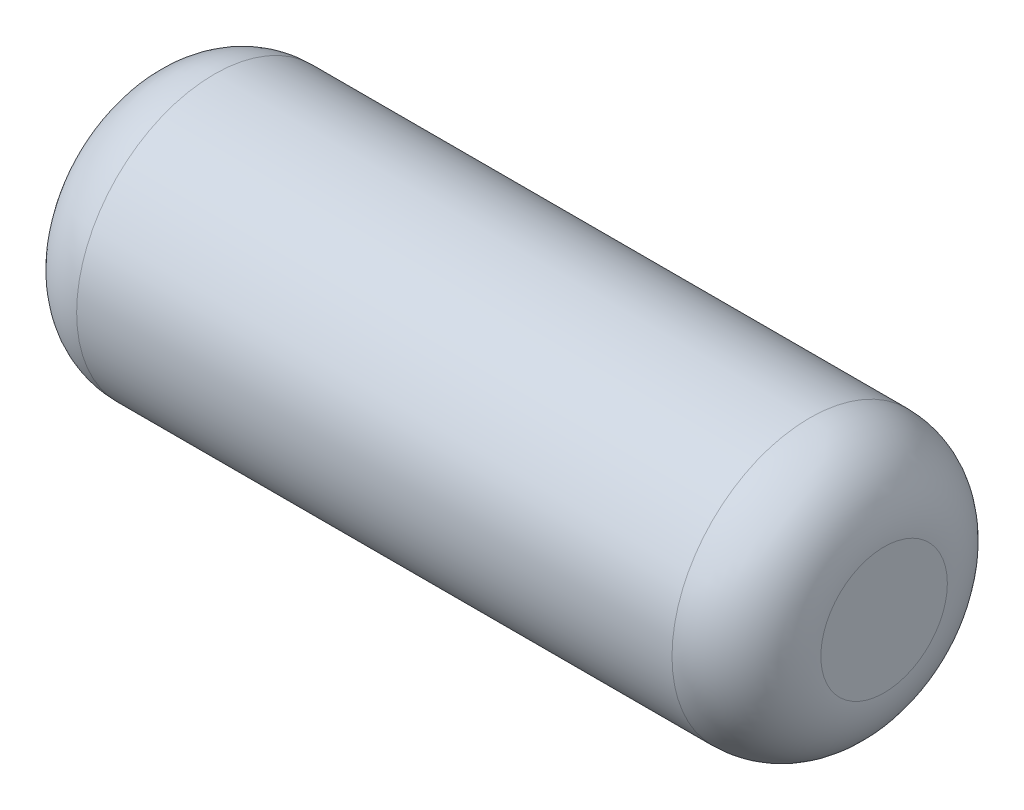
ISO-10303-21;
HEADER;
FILE_DESCRIPTION(('STEP AP214'),'2;1');
FILE_NAME('part.step','',(''),(''),'','','');
FILE_SCHEMA(('AUTOMOTIVE_DESIGN { 1 0 10303 214 1 1 1 1 }'));
ENDSEC;
DATA;
#1=APPLICATION_CONTEXT('core data for automotive mechanical design processes');
#2=APPLICATION_PROTOCOL_DEFINITION('international standard','automotive_design',2000,#1);
#3=PRODUCT_CONTEXT('',#1,'mechanical');
#4=PRODUCT('Part','Part','',(#3));
#5=PRODUCT_RELATED_PRODUCT_CATEGORY('part','',(#4));
#6=PRODUCT_DEFINITION_FORMATION('','',#4);
#7=PRODUCT_DEFINITION_CONTEXT('part definition',#1,'design');
#8=PRODUCT_DEFINITION('design','',#6,#7);
#9=PRODUCT_DEFINITION_SHAPE('','',#8);
#10=(LENGTH_UNIT() NAMED_UNIT(*) SI_UNIT(.MILLI.,.METRE.));
#11=(NAMED_UNIT(*) PLANE_ANGLE_UNIT() SI_UNIT($,.RADIAN.));
#12=(NAMED_UNIT(*) SI_UNIT($,.STERADIAN.) SOLID_ANGLE_UNIT());
#13=UNCERTAINTY_MEASURE_WITH_UNIT(LENGTH_MEASURE(1.E-05),#10,'distance_accuracy_value','');
#14=(GEOMETRIC_REPRESENTATION_CONTEXT(3) GLOBAL_UNCERTAINTY_ASSIGNED_CONTEXT((#13)) GLOBAL_UNIT_ASSIGNED_CONTEXT((#10,
#11,#12)) REPRESENTATION_CONTEXT('',''));
#15=CARTESIAN_POINT('',(0.,0.,0.));
#16=DIRECTION('',(0.,0.,1.));
#17=DIRECTION('',(1.,0.,0.));
#18=AXIS2_PLACEMENT_3D('',#15,#16,#17);
#19=CARTESIAN_POINT('',(12.7,0.,0.));
#20=DIRECTION('',(-1.,0.,0.));
#21=DIRECTION('',(0.,0.,1.));
#22=AXIS2_PLACEMENT_3D('',#19,#20,#21);
#23=CYLINDRICAL_SURFACE('',#22,4.699);
#24=CARTESIAN_POINT('',(-10.16,0.,0.));
#25=DIRECTION('',(1.,0.,0.));
#26=DIRECTION('',(0.,0.,-1.));
#27=AXIS2_PLACEMENT_3D('',#24,#25,#26);
#28=CIRCLE('',#27,4.699);
#29=CARTESIAN_POINT('',(-10.16,0.,-4.699));
#30=VERTEX_POINT('',#29);
#31=EDGE_CURVE('E48',#30,#30,#28,.T.);
#32=ORIENTED_EDGE('',*,*,#31,.T.);
#33=EDGE_LOOP('',(#32));
#34=FACE_BOUND('',#33,.T.);
#35=CARTESIAN_POINT('',(10.16,0.,0.));
#36=DIRECTION('',(1.,0.,0.));
#37=DIRECTION('',(0.,0.,-1.));
#38=AXIS2_PLACEMENT_3D('',#35,#36,#37);
#39=CIRCLE('',#38,4.699);
#40=CARTESIAN_POINT('',(10.16,0.,-4.699));
#41=VERTEX_POINT('',#40);
#42=EDGE_CURVE('E52',#41,#41,#39,.F.);
#43=ORIENTED_EDGE('',*,*,#42,.T.);
#44=EDGE_LOOP('',(#43));
#45=FACE_BOUND('',#44,.T.);
#46=ADVANCED_FACE('F37',(#34,#45),#23,.T.);
#47=CARTESIAN_POINT('',(12.7,0.,0.));
#48=DIRECTION('',(1.,0.,0.));
#49=DIRECTION('',(0.,0.,-1.));
#50=AXIS2_PLACEMENT_3D('',#47,#48,#49);
#51=PLANE('',#50);
#52=CARTESIAN_POINT('',(12.7,0.,0.));
#53=DIRECTION('',(1.,0.,0.));
#54=DIRECTION('',(0.,0.,-1.));
#55=AXIS2_PLACEMENT_3D('',#52,#53,#54);
#56=CIRCLE('',#55,2.159);
#57=CARTESIAN_POINT('',(12.7,0.,-2.159));
#58=VERTEX_POINT('',#57);
#59=EDGE_CURVE('E10',#58,#58,#56,.T.);
#60=ORIENTED_EDGE('',*,*,#59,.T.);
#61=EDGE_LOOP('',(#60));
#62=FACE_BOUND('',#61,.T.);
#63=ADVANCED_FACE('F68',(#62),#51,.T.);
#64=CARTESIAN_POINT('',(-12.7,0.,0.));
#65=DIRECTION('',(1.,0.,0.));
#66=DIRECTION('',(0.,0.,-1.));
#67=AXIS2_PLACEMENT_3D('',#64,#65,#66);
#68=PLANE('',#67);
#69=CARTESIAN_POINT('',(-12.7,0.,0.));
#70=DIRECTION('',(1.,0.,0.));
#71=DIRECTION('',(0.,0.,-1.));
#72=AXIS2_PLACEMENT_3D('',#69,#70,#71);
#73=CIRCLE('',#72,2.159);
#74=CARTESIAN_POINT('',(-12.7,0.,-2.159));
#75=VERTEX_POINT('',#74);
#76=EDGE_CURVE('E44',#75,#75,#73,.F.);
#77=ORIENTED_EDGE('',*,*,#76,.T.);
#78=EDGE_LOOP('',(#77));
#79=FACE_BOUND('',#78,.T.);
#80=ADVANCED_FACE('F65',(#79),#68,.F.);
#81=CARTESIAN_POINT('',(-10.16,0.,0.));
#82=DIRECTION('',(1.,0.,0.));
#83=DIRECTION('',(0.,0.,-1.));
#84=AXIS2_PLACEMENT_3D('',#81,#82,#83);
#85=DEGENERATE_TOROIDAL_SURFACE('',#84,2.159,2.54,.T.);
#86=ORIENTED_EDGE('',*,*,#76,.F.);
#87=EDGE_LOOP('',(#86));
#88=FACE_BOUND('',#87,.T.);
#89=ORIENTED_EDGE('',*,*,#31,.F.);
#90=EDGE_LOOP('',(#89));
#91=FACE_BOUND('',#90,.T.);
#92=ADVANCED_FACE('F61',(#88,#91),#85,.T.);
#93=CARTESIAN_POINT('',(10.16,0.,0.));
#94=DIRECTION('',(1.,0.,0.));
#95=DIRECTION('',(0.,0.,-1.));
#96=AXIS2_PLACEMENT_3D('',#93,#94,#95);
#97=DEGENERATE_TOROIDAL_SURFACE('',#96,2.159,2.54,.T.);
#98=ORIENTED_EDGE('',*,*,#42,.F.);
#99=EDGE_LOOP('',(#98));
#100=FACE_BOUND('',#99,.T.);
#101=ORIENTED_EDGE('',*,*,#59,.F.);
#102=EDGE_LOOP('',(#101));
#103=FACE_BOUND('',#102,.T.);
#104=ADVANCED_FACE('F39',(#100,#103),#97,.T.);
#105=CLOSED_SHELL('',(#46,#63,#80,#92,#104));
#106=MANIFOLD_SOLID_BREP('B2',#105);
#107=ADVANCED_BREP_SHAPE_REPRESENTATION('',(#18,#106),#14);
#108=SHAPE_DEFINITION_REPRESENTATION(#9,#107);
ENDSEC;
END-ISO-10303-21;
